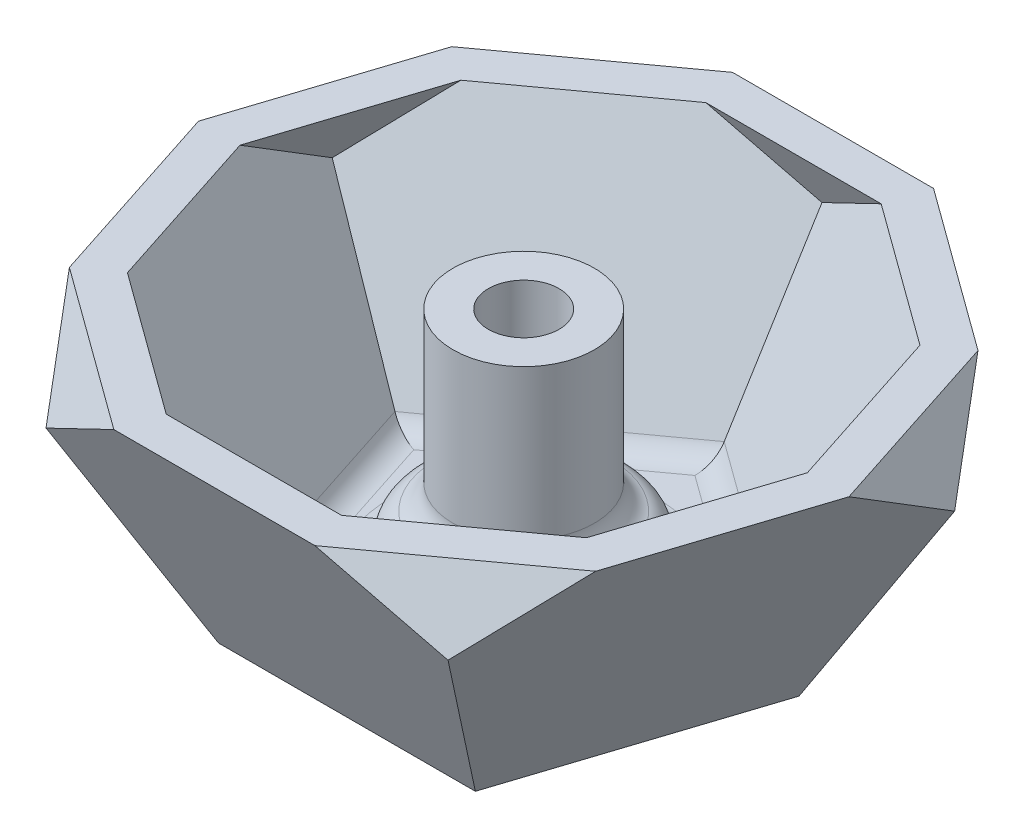
ISO-10303-21;
HEADER;
FILE_DESCRIPTION(('STEP AP214'),'2;1');
FILE_NAME('part.step','',(''),(''),'','','');
FILE_SCHEMA(('AUTOMOTIVE_DESIGN { 1 0 10303 214 1 1 1 1 }'));
ENDSEC;
DATA;
#1=APPLICATION_CONTEXT('core data for automotive mechanical design processes');
#2=APPLICATION_PROTOCOL_DEFINITION('international standard','automotive_design',2000,#1);
#3=PRODUCT_CONTEXT('',#1,'mechanical');
#4=PRODUCT('Part','Part','',(#3));
#5=PRODUCT_RELATED_PRODUCT_CATEGORY('part','',(#4));
#6=PRODUCT_DEFINITION_FORMATION('','',#4);
#7=PRODUCT_DEFINITION_CONTEXT('part definition',#1,'design');
#8=PRODUCT_DEFINITION('design','',#6,#7);
#9=PRODUCT_DEFINITION_SHAPE('','',#8);
#10=(LENGTH_UNIT() NAMED_UNIT(*) SI_UNIT(.MILLI.,.METRE.));
#11=(NAMED_UNIT(*) PLANE_ANGLE_UNIT() SI_UNIT($,.RADIAN.));
#12=(NAMED_UNIT(*) SI_UNIT($,.STERADIAN.) SOLID_ANGLE_UNIT());
#13=UNCERTAINTY_MEASURE_WITH_UNIT(LENGTH_MEASURE(1.E-05),#10,'distance_accuracy_value','');
#14=(GEOMETRIC_REPRESENTATION_CONTEXT(3) GLOBAL_UNCERTAINTY_ASSIGNED_CONTEXT((#13)) GLOBAL_UNIT_ASSIGNED_CONTEXT((#10,
#11,#12)) REPRESENTATION_CONTEXT('',''));
#15=CARTESIAN_POINT('',(0.,0.,0.));
#16=DIRECTION('',(0.,0.,1.));
#17=DIRECTION('',(1.,0.,0.));
#18=AXIS2_PLACEMENT_3D('',#15,#16,#17);
#19=CARTESIAN_POINT('',(0.,2.,0.));
#20=DIRECTION('',(0.,1.,0.));
#21=DIRECTION('',(0.,0.,1.));
#22=AXIS2_PLACEMENT_3D('',#19,#20,#21);
#23=PLANE('',#22);
#24=CARTESIAN_POINT('',(0.,2.,0.));
#25=DIRECTION('',(0.,1.,0.));
#26=DIRECTION('',(0.,0.,1.));
#27=AXIS2_PLACEMENT_3D('',#24,#25,#26);
#28=CIRCLE('',#27,7.5);
#29=CARTESIAN_POINT('',(0.,2.,7.5));
#30=VERTEX_POINT('',#29);
#31=EDGE_CURVE('E363',#30,#30,#28,.F.);
#32=ORIENTED_EDGE('',*,*,#31,.T.);
#33=EDGE_LOOP('',(#32));
#34=FACE_BOUND('',#33,.T.);
#35=DIRECTION('',(-0.309016994374946,0.,0.951056516295154));
#36=VECTOR('',#35,1.);
#37=CARTESIAN_POINT('',(9.42094211153315,2.,-3.63399866594965));
#38=LINE('',#37,#36);
#39=CARTESIAN_POINT('',(5.69382736211469,2.,7.83688103949869));
#40=VERTEX_POINT('',#39);
#41=CARTESIAN_POINT('',(9.21280619797569,2.,-2.99342219129891));
#42=VERTEX_POINT('',#41);
#43=EDGE_CURVE('E358',#40,#42,#38,.F.);
#44=ORIENTED_EDGE('',*,*,#43,.T.);
#45=DIRECTION('',(0.809016994374949,0.,0.587785252292472));
#46=VECTOR('',#45,1.);
#47=CARTESIAN_POINT('',(-0.544906895972963,2.,-10.0828157301274));
#48=LINE('',#47,#46);
#49=CARTESIAN_POINT('',(0.,2.,-9.68691769639961));
#50=VERTEX_POINT('',#49);
#51=EDGE_CURVE('E360',#42,#50,#48,.F.);
#52=ORIENTED_EDGE('',*,*,#51,.T.);
#53=DIRECTION('',(0.809016994374947,0.,-0.587785252292474));
#54=VECTOR('',#53,1.);
#55=CARTESIAN_POINT('',(-9.75771309394865,2.,-2.59752415757114));
#56=LINE('',#55,#54);
#57=CARTESIAN_POINT('',(-9.21280619797569,2.,-2.99342219129888));
#58=VERTEX_POINT('',#57);
#59=EDGE_CURVE('E352',#50,#58,#56,.F.);
#60=ORIENTED_EDGE('',*,*,#59,.T.);
#61=DIRECTION('',(-0.309016994374949,0.,-0.951056516295153));
#62=VECTOR('',#61,1.);
#63=CARTESIAN_POINT('',(-5.48569144855719,2.,8.47745751414945));
#64=LINE('',#63,#62);
#65=CARTESIAN_POINT('',(-5.69382736211466,2.,7.83688103949871));
#66=VERTEX_POINT('',#65);
#67=EDGE_CURVE('E354',#58,#66,#64,.F.);
#68=ORIENTED_EDGE('',*,*,#67,.T.);
#69=DIRECTION('',(-1.,0.,0.));
#70=VECTOR('',#69,1.);
#71=CARTESIAN_POINT('',(6.36736932694566,2.,7.83688103949869));
#72=LINE('',#71,#70);
#73=EDGE_CURVE('E356',#66,#40,#72,.F.);
#74=ORIENTED_EDGE('',*,*,#73,.T.);
#75=EDGE_LOOP('',(#44,#52,#60,#68,#74));
#76=FACE_BOUND('',#75,.T.);
#77=ADVANCED_FACE('F40',(#34,#76),#23,.T.);
#78=CARTESIAN_POINT('',(11.7557050458495,0.,-3.81966011250107));
#79=DIRECTION('',(0.525731112105726,-0.447213595545573,-0.723606797731528));
#80=DIRECTION('',(-0.809016994374948,0.,-0.587785252292472));
#81=AXIS2_PLACEMENT_3D('',#78,#79,#80);
#82=PLANE('',#81);
#83=DIRECTION('',(0.809016994374948,0.,0.587785252292472));
#84=VECTOR('',#83,1.);
#85=CARTESIAN_POINT('',(16.1640944386051,15.,-9.88728757108681));
#86=LINE('',#85,#84);
#87=CARTESIAN_POINT('',(14.8863891469741,15.,-10.8155948037142));
#88=VERTEX_POINT('',#87);
#89=CARTESIAN_POINT('',(5.68609468438653,15.,-17.5000000009563));
#90=VERTEX_POINT('',#89);
#91=EDGE_CURVE('E273',#88,#90,#86,.F.);
#92=ORIENTED_EDGE('',*,*,#91,.F.);
#93=DIRECTION('',(-0.500000000017621,0.52573111207063,-0.688190960259838));
#94=VECTOR('',#93,1.);
#95=CARTESIAN_POINT('',(20.4539709689218,9.1458980346127,-3.1524758432414));
#96=LINE('',#95,#94);
#97=CARTESIAN_POINT('',(18.4005889251751,11.3049516852663,-5.97871376407452));
#98=VERTEX_POINT('',#97);
#99=EDGE_CURVE('E315',#98,#88,#96,.T.);
#100=ORIENTED_EDGE('',*,*,#99,.F.);
#101=DIRECTION('',(-0.50000000004613,-0.850650808322063,0.162459848131442));
#102=VECTOR('',#101,1.);
#103=CARTESIAN_POINT('',(11.7557050458495,0.,-3.81966011250107));
#104=LINE('',#103,#102);
#105=CARTESIAN_POINT('',(11.7557050458495,0.,-3.81966011250107));
#106=VERTEX_POINT('',#105);
#107=EDGE_CURVE('E333',#98,#106,#104,.T.);
#108=ORIENTED_EDGE('',*,*,#107,.T.);
#109=DIRECTION('',(-0.809016994374948,0.,-0.587785252292472));
#110=VECTOR('',#109,1.);
#111=CARTESIAN_POINT('',(11.7557050458495,0.,-3.81966011250107));
#112=LINE('',#111,#110);
#113=CARTESIAN_POINT('',(0.,0.,-12.3606797749979));
#114=VERTEX_POINT('',#113);
#115=EDGE_CURVE('E318',#106,#114,#112,.T.);
#116=ORIENTED_EDGE('',*,*,#115,.T.);
#117=DIRECTION('',(0.,-0.850650808322063,0.525731112167637));
#118=VECTOR('',#117,1.);
#119=CARTESIAN_POINT('',(0.,0.,-12.3606797749979));
#120=LINE('',#119,#118);
#121=CARTESIAN_POINT('',(0.,11.3049516852663,-19.3475241585587));
#122=VERTEX_POINT('',#121);
#123=EDGE_CURVE('E334',#122,#114,#120,.T.);
#124=ORIENTED_EDGE('',*,*,#123,.F.);
#125=DIRECTION('',(-0.809016994403458,-0.52573111207063,-0.262865556068829));
#126=VECTOR('',#125,1.);
#127=CARTESIAN_POINT('',(6.18812322495092,15.3262379217593,-17.3368810400558));
#128=LINE('',#127,#126);
#129=EDGE_CURVE('E296',#90,#122,#128,.T.);
#130=ORIENTED_EDGE('',*,*,#129,.F.);
#131=EDGE_LOOP('',(#92,#100,#108,#116,#124,#130));
#132=FACE_BOUND('',#131,.T.);
#133=ADVANCED_FACE('F412',(#132),#82,.T.);
#134=CARTESIAN_POINT('',(0.,0.,-12.3606797749979));
#135=DIRECTION('',(-0.525731112105729,-0.447213595545573,-0.723606797731526));
#136=DIRECTION('',(-0.809016994374947,0.,0.587785252292474));
#137=AXIS2_PLACEMENT_3D('',#134,#135,#136);
#138=PLANE('',#137);
#139=DIRECTION('',(0.809016994374947,0.,-0.587785252292474));
#140=VECTOR('',#139,1.);
#141=CARTESIAN_POINT('',(-4.40838939275564,15.,-18.4283072335836));
#142=LINE('',#141,#140);
#143=CARTESIAN_POINT('',(-5.68609468438658,15.,-17.5000000009562));
#144=VERTEX_POINT('',#143);
#145=CARTESIAN_POINT('',(-14.8863891469741,15.,-10.8155948037141));
#146=VERTEX_POINT('',#145);
#147=EDGE_CURVE('E222',#144,#146,#142,.F.);
#148=ORIENTED_EDGE('',*,*,#147,.F.);
#149=DIRECTION('',(-0.809016994403457,0.52573111207063,0.262865556068831));
#150=VECTOR('',#149,1.);
#151=CARTESIAN_POINT('',(3.32244193867087,9.14589803461271,-20.4270509840231));
#152=LINE('',#151,#150);
#153=EDGE_CURVE('E293',#122,#144,#152,.T.);
#154=ORIENTED_EDGE('',*,*,#153,.F.);
#155=ORIENTED_EDGE('',*,*,#123,.T.);
#156=DIRECTION('',(-0.809016994374947,0.,0.587785252292474));
#157=VECTOR('',#156,1.);
#158=CARTESIAN_POINT('',(0.,0.,-12.3606797749979));
#159=LINE('',#158,#157);
#160=CARTESIAN_POINT('',(-11.7557050458495,0.,-3.81966011250103));
#161=VERTEX_POINT('',#160);
#162=EDGE_CURVE('E321',#114,#161,#159,.T.);
#163=ORIENTED_EDGE('',*,*,#162,.T.);
#164=DIRECTION('',(0.50000000004613,-0.850650808322063,0.162459848131441));
#165=VECTOR('',#164,1.);
#166=CARTESIAN_POINT('',(-11.7557050458495,0.,-3.81966011250103));
#167=LINE('',#166,#165);
#168=CARTESIAN_POINT('',(-18.4005889251751,11.3049516852663,-5.97871376407446));
#169=VERTEX_POINT('',#168);
#170=EDGE_CURVE('E337',#169,#161,#167,.T.);
#171=ORIENTED_EDGE('',*,*,#170,.F.);
#172=DIRECTION('',(-0.500000000017619,-0.52573111207063,0.688190960259839));
#173=VECTOR('',#172,1.);
#174=CARTESIAN_POINT('',(-14.5761184455828,15.3262379217593,-11.242645787561));
#175=LINE('',#174,#173);
#176=EDGE_CURVE('E301',#146,#169,#175,.T.);
#177=ORIENTED_EDGE('',*,*,#176,.F.);
#178=EDGE_LOOP('',(#148,#154,#155,#163,#171,#177));
#179=FACE_BOUND('',#178,.T.);
#180=ADVANCED_FACE('F418',(#179),#138,.T.);
#181=CARTESIAN_POINT('',(-11.7557050458495,0.,-3.81966011250103));
#182=DIRECTION('',(-0.850650808330348,-0.447213595545573,0.276393202242974));
#183=DIRECTION('',(0.46534112724147,-0.88513142261341,0.));
#184=AXIS2_PLACEMENT_3D('',#181,#182,#183);
#185=PLANE('',#184);
#186=DIRECTION('',(-0.309016994374949,0.,-0.951056516295153));
#187=VECTOR('',#186,1.);
#188=CARTESIAN_POINT('',(-18.8886289189726,15.,-1.50203265439342));
#189=LINE('',#188,#187);
#190=CARTESIAN_POINT('',(-18.4005889251751,15.,0.));
#191=VERTEX_POINT('',#190);
#192=CARTESIAN_POINT('',(-14.8863891469741,15.,10.8155948037142));
#193=VERTEX_POINT('',#192);
#194=EDGE_CURVE('E283',#191,#193,#189,.F.);
#195=ORIENTED_EDGE('',*,*,#194,.F.);
#196=DIRECTION('',(0.,0.52573111207063,0.850650808382017));
#197=VECTOR('',#196,1.);
#198=CARTESIAN_POINT('',(-18.4005889251751,9.14589803461271,-9.47213595481186));
#199=LINE('',#198,#197);
#200=EDGE_CURVE('E298',#169,#191,#199,.T.);
#201=ORIENTED_EDGE('',*,*,#200,.F.);
#202=ORIENTED_EDGE('',*,*,#170,.T.);
#203=DIRECTION('',(0.309016994374949,0.,0.951056516295153));
#204=VECTOR('',#203,1.);
#205=CARTESIAN_POINT('',(-11.7557050458495,0.,-3.81966011250103));
#206=LINE('',#205,#204);
#207=CARTESIAN_POINT('',(-7.26542528005359,0.,10.));
#208=VERTEX_POINT('',#207);
#209=EDGE_CURVE('E324',#161,#208,#206,.T.);
#210=ORIENTED_EDGE('',*,*,#209,.T.);
#211=DIRECTION('',(0.309016994403456,-0.850650808322063,-0.425325404215261));
#212=VECTOR('',#211,1.);
#213=CARTESIAN_POINT('',(-7.26542528005359,0.,10.));
#214=LINE('',#213,#212);
#215=CARTESIAN_POINT('',(-11.3721893687731,11.3049516852663,15.6524758433538));
#216=VERTEX_POINT('',#215);
#217=EDGE_CURVE('E341',#216,#208,#214,.T.);
#218=ORIENTED_EDGE('',*,*,#217,.F.);
#219=DIRECTION('',(0.500000000017621,-0.52573111207063,0.688190960259838));
#220=VECTOR('',#219,1.);
#221=CARTESIAN_POINT('',(-15.1966598483654,15.3262379217593,10.3885438198673));
#222=LINE('',#221,#220);
#223=EDGE_CURVE('E306',#193,#216,#222,.T.);
#224=ORIENTED_EDGE('',*,*,#223,.F.);
#225=EDGE_LOOP('',(#195,#201,#202,#210,#218,#224));
#226=FACE_BOUND('',#225,.T.);
#227=ADVANCED_FACE('F460',(#226),#185,.T.);
#228=CARTESIAN_POINT('',(-7.26542528005359,0.,10.));
#229=DIRECTION('',(0.,-0.447213595545573,0.894427190977108));
#230=DIRECTION('',(0.,-0.894427190977108,-0.447213595545573));
#231=AXIS2_PLACEMENT_3D('',#228,#229,#230);
#232=PLANE('',#231);
#233=DIRECTION('',(-1.,0.,0.));
#234=VECTOR('',#233,1.);
#235=CARTESIAN_POINT('',(-7.26542528005358,15.,17.5000000009563));
#236=LINE('',#235,#234);
#237=CARTESIAN_POINT('',(-5.68609468438655,15.,17.5000000009563));
#238=VERTEX_POINT('',#237);
#239=CARTESIAN_POINT('',(5.68609468438658,15.,17.5000000009562));
#240=VERTEX_POINT('',#239);
#241=EDGE_CURVE('E291',#238,#240,#236,.F.);
#242=ORIENTED_EDGE('',*,*,#241,.F.);
#243=DIRECTION('',(0.809016994403457,0.525731112070631,0.262865556068829));
#244=VECTOR('',#243,1.);
#245=CARTESIAN_POINT('',(-14.694631307444,9.14589803461271,14.5729490178894));
#246=LINE('',#245,#244);
#247=EDGE_CURVE('E303',#216,#238,#246,.T.);
#248=ORIENTED_EDGE('',*,*,#247,.F.);
#249=ORIENTED_EDGE('',*,*,#217,.T.);
#250=DIRECTION('',(1.,0.,0.));
#251=VECTOR('',#250,1.);
#252=CARTESIAN_POINT('',(-7.26542528005359,0.,10.));
#253=LINE('',#252,#251);
#254=CARTESIAN_POINT('',(7.26542528005363,0.,9.99999999999998));
#255=VERTEX_POINT('',#254);
#256=EDGE_CURVE('E327',#208,#255,#253,.T.);
#257=ORIENTED_EDGE('',*,*,#256,.T.);
#258=DIRECTION('',(-0.309016994403458,-0.850650808322063,-0.42532540421526));
#259=VECTOR('',#258,1.);
#260=CARTESIAN_POINT('',(7.26542528005363,0.,9.99999999999998));
#261=LINE('',#260,#259);
#262=CARTESIAN_POINT('',(11.3721893687732,11.3049516852663,15.6524758433538));
#263=VERTEX_POINT('',#262);
#264=EDGE_CURVE('E339',#263,#255,#261,.T.);
#265=ORIENTED_EDGE('',*,*,#264,.F.);
#266=DIRECTION('',(0.809016994403457,-0.52573111207063,-0.262865556068831));
#267=VECTOR('',#266,1.);
#268=CARTESIAN_POINT('',(5.1840661438222,15.3262379217593,17.6631189618567));
#269=LINE('',#268,#267);
#270=EDGE_CURVE('E311',#240,#263,#269,.T.);
#271=ORIENTED_EDGE('',*,*,#270,.F.);
#272=EDGE_LOOP('',(#242,#248,#249,#257,#265,#271));
#273=FACE_BOUND('',#272,.T.);
#274=ADVANCED_FACE('F456',(#273),#232,.T.);
#275=CARTESIAN_POINT('',(7.26542528005363,0.,9.99999999999998));
#276=DIRECTION('',(0.850650808330349,-0.447213595545573,0.276393202242972));
#277=DIRECTION('',(0.465341127241469,0.88513142261341,0.));
#278=AXIS2_PLACEMENT_3D('',#275,#276,#277);
#279=PLANE('',#278);
#280=DIRECTION('',(-0.309016994374946,0.,0.951056516295154));
#281=VECTOR('',#280,1.);
#282=CARTESIAN_POINT('',(14.3983491531767,15.,12.3176274581076));
#283=LINE('',#282,#281);
#284=CARTESIAN_POINT('',(14.8863891469741,15.,10.8155948037141));
#285=VERTEX_POINT('',#284);
#286=CARTESIAN_POINT('',(18.4005889251751,15.,0.));
#287=VERTEX_POINT('',#286);
#288=EDGE_CURVE('E281',#285,#287,#283,.F.);
#289=ORIENTED_EDGE('',*,*,#288,.F.);
#290=DIRECTION('',(0.500000000017619,0.52573111207063,-0.688190960259839));
#291=VECTOR('',#290,1.);
#292=CARTESIAN_POINT('',(9.31880732502645,9.14589803461271,18.4787137641869));
#293=LINE('',#292,#291);
#294=EDGE_CURVE('E308',#263,#285,#293,.T.);
#295=ORIENTED_EDGE('',*,*,#294,.F.);
#296=ORIENTED_EDGE('',*,*,#264,.T.);
#297=DIRECTION('',(0.309016994374946,0.,-0.951056516295154));
#298=VECTOR('',#297,1.);
#299=CARTESIAN_POINT('',(7.26542528005363,0.,9.99999999999998));
#300=LINE('',#299,#298);
#301=EDGE_CURVE('E330',#255,#106,#300,.T.);
#302=ORIENTED_EDGE('',*,*,#301,.T.);
#303=ORIENTED_EDGE('',*,*,#107,.F.);
#304=DIRECTION('',(0.,-0.52573111207063,-0.850650808382017));
#305=VECTOR('',#304,1.);
#306=CARTESIAN_POINT('',(18.4005889251751,15.3262379217593,0.527864045892893));
#307=LINE('',#306,#305);
#308=EDGE_CURVE('E313',#287,#98,#307,.T.);
#309=ORIENTED_EDGE('',*,*,#308,.F.);
#310=EDGE_LOOP('',(#289,#295,#296,#302,#303,#309));
#311=FACE_BOUND('',#310,.T.);
#312=ADVANCED_FACE('F434',(#311),#279,.T.);
#313=CARTESIAN_POINT('',(11.7557050458495,30.,3.81966011250104));
#314=DIRECTION('',(-0.850650808330348,-0.447213595545573,0.276393202242974));
#315=DIRECTION('',(0.46534112724147,-0.88513142261341,0.));
#316=AXIS2_PLACEMENT_3D('',#313,#314,#315);
#317=PLANE('',#316);
#318=ORIENTED_EDGE('',*,*,#99,.T.);
#319=DIRECTION('',(-0.309016994374948,0.,-0.951056516295153));
#320=VECTOR('',#319,1.);
#321=CARTESIAN_POINT('',(18.8886289189726,15.,1.50203265439343));
#322=LINE('',#321,#320);
#323=EDGE_CURVE('E278',#88,#287,#322,.F.);
#324=ORIENTED_EDGE('',*,*,#323,.T.);
#325=ORIENTED_EDGE('',*,*,#308,.T.);
#326=EDGE_LOOP('',(#318,#324,#325));
#327=FACE_BOUND('',#326,.T.);
#328=ADVANCED_FACE('F430',(#327),#317,.F.);
#329=CARTESIAN_POINT('',(0.,30.,12.3606797749979));
#330=DIRECTION('',(-0.525731112105728,-0.447213595545573,-0.723606797731526));
#331=DIRECTION('',(-0.809016994374947,0.,0.587785252292474));
#332=AXIS2_PLACEMENT_3D('',#329,#330,#331);
#333=PLANE('',#332);
#334=ORIENTED_EDGE('',*,*,#294,.T.);
#335=DIRECTION('',(0.809016994374947,0.,-0.587785252292474));
#336=VECTOR('',#335,1.);
#337=CARTESIAN_POINT('',(4.40838939275563,15.,18.4283072335836));
#338=LINE('',#337,#336);
#339=EDGE_CURVE('E288',#285,#240,#338,.F.);
#340=ORIENTED_EDGE('',*,*,#339,.T.);
#341=ORIENTED_EDGE('',*,*,#270,.T.);
#342=EDGE_LOOP('',(#334,#340,#341));
#343=FACE_BOUND('',#342,.T.);
#344=ADVANCED_FACE('F433',(#343),#333,.F.);
#345=CARTESIAN_POINT('',(-11.7557050458495,30.,3.81966011250106));
#346=DIRECTION('',(0.525731112105727,-0.447213595545573,-0.723606797731527));
#347=DIRECTION('',(-0.809016994374948,0.,-0.587785252292472));
#348=AXIS2_PLACEMENT_3D('',#345,#346,#347);
#349=PLANE('',#348);
#350=ORIENTED_EDGE('',*,*,#247,.T.);
#351=DIRECTION('',(0.809016994374948,0.,0.587785252292472));
#352=VECTOR('',#351,1.);
#353=CARTESIAN_POINT('',(-16.1640944386051,15.,9.88728757108679));
#354=LINE('',#353,#352);
#355=EDGE_CURVE('E285',#238,#193,#354,.F.);
#356=ORIENTED_EDGE('',*,*,#355,.T.);
#357=ORIENTED_EDGE('',*,*,#223,.T.);
#358=EDGE_LOOP('',(#350,#356,#357));
#359=FACE_BOUND('',#358,.T.);
#360=ADVANCED_FACE('F438',(#359),#349,.F.);
#361=CARTESIAN_POINT('',(-7.26542528005362,30.,-9.99999999999999));
#362=DIRECTION('',(0.850650808330349,-0.447213595545573,0.276393202242972));
#363=DIRECTION('',(0.465341127241469,0.88513142261341,0.));
#364=AXIS2_PLACEMENT_3D('',#361,#362,#363);
#365=PLANE('',#364);
#366=ORIENTED_EDGE('',*,*,#200,.T.);
#367=DIRECTION('',(-0.309016994374947,0.,0.951056516295154));
#368=VECTOR('',#367,1.);
#369=CARTESIAN_POINT('',(-14.3983491531767,15.,-12.3176274581076));
#370=LINE('',#369,#368);
#371=EDGE_CURVE('E275',#191,#146,#370,.F.);
#372=ORIENTED_EDGE('',*,*,#371,.T.);
#373=ORIENTED_EDGE('',*,*,#176,.T.);
#374=EDGE_LOOP('',(#366,#372,#373));
#375=FACE_BOUND('',#374,.T.);
#376=ADVANCED_FACE('F442',(#375),#365,.F.);
#377=CARTESIAN_POINT('',(7.26542528005359,30.,-10.));
#378=DIRECTION('',(0.,-0.447213595545573,0.894427190977108));
#379=DIRECTION('',(0.,-0.894427190977108,-0.447213595545574));
#380=AXIS2_PLACEMENT_3D('',#377,#378,#379);
#381=PLANE('',#380);
#382=ORIENTED_EDGE('',*,*,#153,.T.);
#383=DIRECTION('',(-1.,0.,0.));
#384=VECTOR('',#383,1.);
#385=CARTESIAN_POINT('',(7.26542528005359,15.,-17.5000000009563));
#386=LINE('',#385,#384);
#387=EDGE_CURVE('E336',#144,#90,#386,.F.);
#388=ORIENTED_EDGE('',*,*,#387,.T.);
#389=ORIENTED_EDGE('',*,*,#129,.T.);
#390=EDGE_LOOP('',(#382,#388,#389));
#391=FACE_BOUND('',#390,.T.);
#392=ADVANCED_FACE('F446',(#391),#381,.F.);
#393=CARTESIAN_POINT('',(0.,0.,0.));
#394=DIRECTION('',(0.,1.,0.));
#395=DIRECTION('',(0.,0.,1.));
#396=AXIS2_PLACEMENT_3D('',#393,#394,#395);
#397=PLANE('',#396);
#398=CARTESIAN_POINT('',(0.,0.,0.));
#399=DIRECTION('',(0.,1.,0.));
#400=DIRECTION('',(0.,0.,1.));
#401=AXIS2_PLACEMENT_3D('',#398,#399,#400);
#402=CIRCLE('',#401,4.5);
#403=CARTESIAN_POINT('',(0.,0.,4.5));
#404=VERTEX_POINT('',#403);
#405=EDGE_CURVE('E391',#404,#404,#402,.F.);
#406=ORIENTED_EDGE('',*,*,#405,.F.);
#407=EDGE_LOOP('',(#406));
#408=FACE_BOUND('',#407,.T.);
#409=ORIENTED_EDGE('',*,*,#115,.F.);
#410=ORIENTED_EDGE('',*,*,#301,.F.);
#411=ORIENTED_EDGE('',*,*,#256,.F.);
#412=ORIENTED_EDGE('',*,*,#209,.F.);
#413=ORIENTED_EDGE('',*,*,#162,.F.);
#414=EDGE_LOOP('',(#409,#410,#411,#412,#413));
#415=FACE_BOUND('',#414,.T.);
#416=ADVANCED_FACE('F428',(#408,#415),#397,.F.);
#417=CARTESIAN_POINT('',(0.,15.,0.));
#418=DIRECTION('',(0.,1.,0.));
#419=DIRECTION('',(0.,0.,1.));
#420=AXIS2_PLACEMENT_3D('',#417,#418,#419);
#421=PLANE('',#420);
#422=DIRECTION('',(-1.,0.,0.));
#423=VECTOR('',#422,1.);
#424=CARTESIAN_POINT('',(-7.26542528005358,15.,15.2639320233994));
#425=LINE('',#424,#423);
#426=CARTESIAN_POINT('',(-4.95955215636267,15.,15.2639320233994));
#427=VERTEX_POINT('',#426);
#428=CARTESIAN_POINT('',(4.9595521563627,15.,15.2639320233994));
#429=VERTEX_POINT('',#428);
#430=EDGE_CURVE('E215',#427,#429,#425,.F.);
#431=ORIENTED_EDGE('',*,*,#430,.F.);
#432=DIRECTION('',(0.809016994374948,0.,0.587785252292472));
#433=VECTOR('',#432,1.);
#434=CARTESIAN_POINT('',(-14.8497666582737,15.,8.07827057666571));
#435=LINE('',#434,#433);
#436=CARTESIAN_POINT('',(-12.9842761143353,15.,9.43362879242883));
#437=VERTEX_POINT('',#436);
#438=EDGE_CURVE('E261',#427,#437,#435,.F.);
#439=ORIENTED_EDGE('',*,*,#438,.T.);
#440=DIRECTION('',(-0.309016994374949,0.,-0.951056516295153));
#441=VECTOR('',#440,1.);
#442=CARTESIAN_POINT('',(-16.7620018980382,15.,-2.1930156600361));
#443=LINE('',#442,#441);
#444=CARTESIAN_POINT('',(-16.0494479159453,15.,0.));
#445=VERTEX_POINT('',#444);
#446=EDGE_CURVE('E258',#445,#437,#443,.F.);
#447=ORIENTED_EDGE('',*,*,#446,.F.);
#448=DIRECTION('',(-0.309016994374947,0.,0.951056516295154));
#449=VECTOR('',#448,1.);
#450=CARTESIAN_POINT('',(-12.2717221322424,15.,-11.6266444524649));
#451=LINE('',#450,#449);
#452=CARTESIAN_POINT('',(-12.9842761143353,15.,-9.43362879242878));
#453=VERTEX_POINT('',#452);
#454=EDGE_CURVE('E250',#445,#453,#451,.F.);
#455=ORIENTED_EDGE('',*,*,#454,.T.);
#456=DIRECTION('',(0.809016994374947,0.,-0.587785252292474));
#457=VECTOR('',#456,1.);
#458=CARTESIAN_POINT('',(-3.09406161242429,15.,-16.6192902391625));
#459=LINE('',#458,#457);
#460=CARTESIAN_POINT('',(-4.95955215636269,15.,-15.2639320233994));
#461=VERTEX_POINT('',#460);
#462=EDGE_CURVE('E251',#461,#453,#459,.F.);
#463=ORIENTED_EDGE('',*,*,#462,.F.);
#464=DIRECTION('',(-1.,0.,0.));
#465=VECTOR('',#464,1.);
#466=CARTESIAN_POINT('',(7.26542528005359,15.,-15.2639320233994));
#467=LINE('',#466,#465);
#468=CARTESIAN_POINT('',(4.95955215636265,15.,-15.2639320233994));
#469=VERTEX_POINT('',#468);
#470=EDGE_CURVE('E212',#461,#469,#467,.F.);
#471=ORIENTED_EDGE('',*,*,#470,.T.);
#472=DIRECTION('',(0.809016994374948,0.,0.587785252292472));
#473=VECTOR('',#472,1.);
#474=CARTESIAN_POINT('',(14.8497666582737,15.,-8.07827057666573));
#475=LINE('',#474,#473);
#476=CARTESIAN_POINT('',(12.9842761143353,15.,-9.43362879242883));
#477=VERTEX_POINT('',#476);
#478=EDGE_CURVE('E204',#477,#469,#475,.F.);
#479=ORIENTED_EDGE('',*,*,#478,.F.);
#480=DIRECTION('',(-0.309016994374948,0.,-0.951056516295153));
#481=VECTOR('',#480,1.);
#482=CARTESIAN_POINT('',(16.7620018980382,15.,2.1930156600361));
#483=LINE('',#482,#481);
#484=CARTESIAN_POINT('',(16.0494479159453,15.,0.));
#485=VERTEX_POINT('',#484);
#486=EDGE_CURVE('E257',#477,#485,#483,.F.);
#487=ORIENTED_EDGE('',*,*,#486,.T.);
#488=DIRECTION('',(-0.309016994374946,0.,0.951056516295154));
#489=VECTOR('',#488,1.);
#490=CARTESIAN_POINT('',(12.2717221322424,15.,11.6266444524649));
#491=LINE('',#490,#489);
#492=CARTESIAN_POINT('',(12.9842761143353,15.,9.43362879242878));
#493=VERTEX_POINT('',#492);
#494=EDGE_CURVE('E262',#493,#485,#491,.F.);
#495=ORIENTED_EDGE('',*,*,#494,.F.);
#496=DIRECTION('',(0.809016994374947,0.,-0.587785252292474));
#497=VECTOR('',#496,1.);
#498=CARTESIAN_POINT('',(3.09406161242428,15.,16.6192902391625));
#499=LINE('',#498,#497);
#500=EDGE_CURVE('E265',#493,#429,#499,.F.);
#501=ORIENTED_EDGE('',*,*,#500,.T.);
#502=EDGE_LOOP('',(#431,#439,#447,#455,#463,#471,#479,#487,#495,#501));
#503=FACE_BOUND('',#502,.T.);
#504=ORIENTED_EDGE('',*,*,#241,.T.);
#505=ORIENTED_EDGE('',*,*,#339,.F.);
#506=ORIENTED_EDGE('',*,*,#288,.T.);
#507=ORIENTED_EDGE('',*,*,#323,.F.);
#508=ORIENTED_EDGE('',*,*,#91,.T.);
#509=ORIENTED_EDGE('',*,*,#387,.F.);
#510=ORIENTED_EDGE('',*,*,#147,.T.);
#511=ORIENTED_EDGE('',*,*,#371,.F.);
#512=ORIENTED_EDGE('',*,*,#194,.T.);
#513=ORIENTED_EDGE('',*,*,#355,.F.);
#514=EDGE_LOOP('',(#504,#505,#506,#507,#508,#509,#510,#511,#512,#513));
#515=FACE_BOUND('',#514,.T.);
#516=ADVANCED_FACE('F425',(#503,#515),#421,.T.);
#517=CARTESIAN_POINT('',(10.704242821638,0.894427191091147,-2.37244651703802));
#518=DIRECTION('',(0.525731112105726,-0.447213595545573,-0.723606797731528));
#519=DIRECTION('',(-0.809016994374948,0.,-0.587785252292472));
#520=AXIS2_PLACEMENT_3D('',#517,#518,#519);
#521=PLANE('',#520);
#522=DIRECTION('',(0.,-0.850650808322063,0.525731112167637));
#523=VECTOR('',#522,1.);
#524=CARTESIAN_POINT('',(0.,1.23606797760179,-10.3606797750879));
#525=LINE('',#524,#523);
#526=CARTESIAN_POINT('',(0.,11.7770876402177,-16.8753882034961));
#527=VERTEX_POINT('',#526);
#528=CARTESIAN_POINT('',(0.,2.82917960668164,-11.3452769098575));
#529=VERTEX_POINT('',#528);
#530=EDGE_CURVE('E200',#527,#529,#525,.T.);
#531=ORIENTED_EDGE('',*,*,#530,.T.);
#532=DIRECTION('',(-0.809016994374948,0.,-0.587785252292472));
#533=VECTOR('',#532,1.);
#534=CARTESIAN_POINT('',(10.5463097621072,2.82917960668164,-3.68293435416847));
#535=LINE('',#534,#533);
#536=CARTESIAN_POINT('',(10.7899995342929,2.82917960668164,-3.50588337103566));
#537=VERTEX_POINT('',#536);
#538=EDGE_CURVE('E366',#529,#537,#535,.F.);
#539=ORIENTED_EDGE('',*,*,#538,.T.);
#540=DIRECTION('',(-0.50000000004613,-0.850650808322063,0.162459848131442));
#541=VECTOR('',#540,1.);
#542=CARTESIAN_POINT('',(9.85359201334471,1.23606797760179,-3.20162612377897));
#543=LINE('',#542,#541);
#544=CARTESIAN_POINT('',(16.0494479159453,11.7770876402177,-5.21478174155482));
#545=VERTEX_POINT('',#544);
#546=EDGE_CURVE('E227',#545,#537,#543,.T.);
#547=ORIENTED_EDGE('',*,*,#546,.F.);
#548=DIRECTION('',(-0.500000000017621,0.52573111207063,-0.688190960259838));
#549=VECTOR('',#548,1.);
#550=CARTESIAN_POINT('',(18.551857936283,9.1458980346127,-1.77050983195605));
#551=LINE('',#550,#549);
#552=EDGE_CURVE('E249',#545,#477,#551,.T.);
#553=ORIENTED_EDGE('',*,*,#552,.T.);
#554=ORIENTED_EDGE('',*,*,#478,.T.);
#555=DIRECTION('',(-0.809016994403458,-0.52573111207063,-0.262865556068829));
#556=VECTOR('',#555,1.);
#557=CARTESIAN_POINT('',(5.46158069692704,15.3262379217593,-15.100813062499));
#558=LINE('',#557,#556);
#559=EDGE_CURVE('E195',#469,#527,#558,.T.);
#560=ORIENTED_EDGE('',*,*,#559,.T.);
#561=EDGE_LOOP('',(#531,#539,#547,#553,#554,#560));
#562=FACE_BOUND('',#561,.T.);
#563=ADVANCED_FACE('F197',(#562),#521,.F.);
#564=CARTESIAN_POINT('',(1.05146222421144,0.894427191091147,-10.9134661795348));
#565=DIRECTION('',(-0.525731112105729,-0.447213595545573,-0.723606797731526));
#566=DIRECTION('',(-0.809016994374947,0.,0.587785252292474));
#567=AXIS2_PLACEMENT_3D('',#564,#565,#566);
#568=PLANE('',#567);
#569=DIRECTION('',(0.50000000004613,-0.850650808322063,0.162459848131441));
#570=VECTOR('',#569,1.);
#571=CARTESIAN_POINT('',(-9.85359201334471,1.23606797760179,-3.20162612377894));
#572=LINE('',#571,#570);
#573=CARTESIAN_POINT('',(-16.0494479159453,11.7770876402177,-5.21478174155477));
#574=VERTEX_POINT('',#573);
#575=CARTESIAN_POINT('',(-10.7899995342929,2.82917960668164,-3.50588337103562));
#576=VERTEX_POINT('',#575);
#577=EDGE_CURVE('E220',#574,#576,#572,.T.);
#578=ORIENTED_EDGE('',*,*,#577,.T.);
#579=DIRECTION('',(-0.809016994374947,0.,0.587785252292474));
#580=VECTOR('',#579,1.);
#581=CARTESIAN_POINT('',(-0.243689772185654,2.82917960668164,-11.1682259267246));
#582=LINE('',#581,#580);
#583=EDGE_CURVE('E219',#576,#529,#582,.F.);
#584=ORIENTED_EDGE('',*,*,#583,.T.);
#585=ORIENTED_EDGE('',*,*,#530,.F.);
#586=DIRECTION('',(-0.809016994403457,0.52573111207063,0.262865556068831));
#587=VECTOR('',#586,1.);
#588=CARTESIAN_POINT('',(4.04898446669476,9.14589803461272,-18.1909830064663));
#589=LINE('',#588,#587);
#590=EDGE_CURVE('E208',#527,#461,#589,.T.);
#591=ORIENTED_EDGE('',*,*,#590,.T.);
#592=ORIENTED_EDGE('',*,*,#462,.T.);
#593=DIRECTION('',(-0.500000000017619,-0.52573111207063,0.688190960259839));
#594=VECTOR('',#593,1.);
#595=CARTESIAN_POINT('',(-12.674005412944,15.3262379217593,-9.86067977627567));
#596=LINE('',#595,#594);
#597=EDGE_CURVE('E230',#453,#574,#596,.T.);
#598=ORIENTED_EDGE('',*,*,#597,.T.);
#599=EDGE_LOOP('',(#578,#584,#585,#591,#592,#598));
#600=FACE_BOUND('',#599,.T.);
#601=ADVANCED_FACE('F217',(#600),#568,.F.);
#602=CARTESIAN_POINT('',(-10.0544034291888,0.894427191091147,-4.37244651698698));
#603=DIRECTION('',(-0.850650808330348,-0.447213595545573,0.276393202242974));
#604=DIRECTION('',(0.46534112724147,-0.88513142261341,0.));
#605=AXIS2_PLACEMENT_3D('',#602,#603,#604);
#606=PLANE('',#605);
#607=DIRECTION('',(0.309016994403456,-0.850650808322063,-0.425325404215261));
#608=VECTOR('',#607,1.);
#609=CARTESIAN_POINT('',(-6.08985477552152,1.23606797760179,8.38196601132289));
#610=LINE('',#609,#608);
#611=CARTESIAN_POINT('',(-9.91910431272533,11.7770876402177,13.6524758433028));
#612=VERTEX_POINT('',#611);
#613=CARTESIAN_POINT('',(-6.66858645078852,2.82917960668164,9.17852182596438));
#614=VERTEX_POINT('',#613);
#615=EDGE_CURVE('E224',#612,#614,#610,.T.);
#616=ORIENTED_EDGE('',*,*,#615,.T.);
#617=DIRECTION('',(0.309016994374949,0.,0.951056516295153));
#618=VECTOR('',#617,1.);
#619=CARTESIAN_POINT('',(-10.6969183240287,2.82917960668164,-3.21940886258516));
#620=LINE('',#619,#618);
#621=EDGE_CURVE('E55',#614,#576,#620,.F.);
#622=ORIENTED_EDGE('',*,*,#621,.T.);
#623=ORIENTED_EDGE('',*,*,#577,.F.);
#624=DIRECTION('',(0.,0.52573111207063,0.850650808382017));
#625=VECTOR('',#624,1.);
#626=CARTESIAN_POINT('',(-16.0494479159453,9.14589803461272,-9.47213595481187));
#627=LINE('',#626,#625);
#628=EDGE_CURVE('E207',#574,#445,#627,.T.);
#629=ORIENTED_EDGE('',*,*,#628,.T.);
#630=ORIENTED_EDGE('',*,*,#446,.T.);
#631=DIRECTION('',(0.500000000017621,-0.52573111207063,0.688190960259838));
#632=VECTOR('',#631,1.);
#633=CARTESIAN_POINT('',(-13.2945468157266,15.3262379217593,9.00657780858193));
#634=LINE('',#633,#632);
#635=EDGE_CURVE('E237',#437,#612,#634,.T.);
#636=ORIENTED_EDGE('',*,*,#635,.T.);
#637=EDGE_LOOP('',(#616,#622,#623,#629,#630,#636));
#638=FACE_BOUND('',#637,.T.);
#639=ADVANCED_FACE('F577',(#638),#606,.F.);
#640=CARTESIAN_POINT('',(-7.26542528005359,0.894427191091147,8.21114561804579));
#641=DIRECTION('',(0.,-0.447213595545573,0.894427190977108));
#642=DIRECTION('',(0.,-0.894427190977108,-0.447213595545573));
#643=AXIS2_PLACEMENT_3D('',#640,#641,#642);
#644=PLANE('',#643);
#645=DIRECTION('',(-0.309016994403458,-0.850650808322063,-0.42532540421526));
#646=VECTOR('',#645,1.);
#647=CARTESIAN_POINT('',(6.08985477552155,1.23606797760179,8.38196601132287));
#648=LINE('',#647,#646);
#649=CARTESIAN_POINT('',(9.91910431272538,11.7770876402177,13.6524758433028));
#650=VERTEX_POINT('',#649);
#651=CARTESIAN_POINT('',(6.66858645078855,2.82917960668164,9.17852182596436));
#652=VERTEX_POINT('',#651);
#653=EDGE_CURVE('E236',#650,#652,#648,.T.);
#654=ORIENTED_EDGE('',*,*,#653,.T.);
#655=DIRECTION('',(1.,0.,0.));
#656=VECTOR('',#655,1.);
#657=CARTESIAN_POINT('',(-6.36736932694563,2.82917960668164,9.17852182596438));
#658=LINE('',#657,#656);
#659=EDGE_CURVE('E63',#652,#614,#658,.F.);
#660=ORIENTED_EDGE('',*,*,#659,.T.);
#661=ORIENTED_EDGE('',*,*,#615,.F.);
#662=DIRECTION('',(0.809016994403457,0.525731112070631,0.262865556068829));
#663=VECTOR('',#662,1.);
#664=CARTESIAN_POINT('',(-13.9680887794201,9.14589803461271,12.3368810403326));
#665=LINE('',#664,#663);
#666=EDGE_CURVE('E232',#612,#427,#665,.T.);
#667=ORIENTED_EDGE('',*,*,#666,.T.);
#668=ORIENTED_EDGE('',*,*,#430,.T.);
#669=DIRECTION('',(0.809016994403457,-0.52573111207063,-0.262865556068831));
#670=VECTOR('',#669,1.);
#671=CARTESIAN_POINT('',(4.45752361579831,15.3262379217593,15.4270509842999));
#672=LINE('',#671,#670);
#673=EDGE_CURVE('E243',#429,#650,#672,.T.);
#674=ORIENTED_EDGE('',*,*,#673,.T.);
#675=EDGE_LOOP('',(#654,#660,#661,#667,#668,#674));
#676=FACE_BOUND('',#675,.T.);
#677=ADVANCED_FACE('F580',(#676),#644,.F.);
#678=CARTESIAN_POINT('',(5.56412366339293,0.894427191091147,9.44721359551404));
#679=DIRECTION('',(0.850650808330349,-0.447213595545573,0.276393202242972));
#680=DIRECTION('',(0.465341127241469,0.88513142261341,0.));
#681=AXIS2_PLACEMENT_3D('',#678,#679,#680);
#682=PLANE('',#681);
#683=ORIENTED_EDGE('',*,*,#546,.T.);
#684=DIRECTION('',(0.309016994374946,0.,-0.951056516295154));
#685=VECTOR('',#684,1.);
#686=CARTESIAN_POINT('',(6.76166766105275,2.82917960668164,8.89204731751389));
#687=LINE('',#686,#685);
#688=EDGE_CURVE('E368',#537,#652,#687,.F.);
#689=ORIENTED_EDGE('',*,*,#688,.T.);
#690=ORIENTED_EDGE('',*,*,#653,.F.);
#691=DIRECTION('',(0.500000000017619,0.52573111207063,-0.688190960259839));
#692=VECTOR('',#691,1.);
#693=CARTESIAN_POINT('',(7.41669429238764,9.14589803461271,17.0967477529016));
#694=LINE('',#693,#692);
#695=EDGE_CURVE('E239',#650,#493,#694,.T.);
#696=ORIENTED_EDGE('',*,*,#695,.T.);
#697=ORIENTED_EDGE('',*,*,#494,.T.);
#698=DIRECTION('',(0.,-0.52573111207063,-0.850650808382017));
#699=VECTOR('',#698,1.);
#700=CARTESIAN_POINT('',(16.0494479159453,15.3262379217593,0.527864045892898));
#701=LINE('',#700,#699);
#702=EDGE_CURVE('E245',#485,#545,#701,.T.);
#703=ORIENTED_EDGE('',*,*,#702,.T.);
#704=EDGE_LOOP('',(#683,#689,#690,#696,#697,#703));
#705=FACE_BOUND('',#704,.T.);
#706=ADVANCED_FACE('F512',(#705),#682,.F.);
#707=CARTESIAN_POINT('',(10.0544034291888,29.1055728089089,4.37244651698698));
#708=DIRECTION('',(-0.850650808330348,-0.447213595545573,0.276393202242974));
#709=DIRECTION('',(0.46534112724147,-0.88513142261341,0.));
#710=AXIS2_PLACEMENT_3D('',#707,#708,#709);
#711=PLANE('',#710);
#712=ORIENTED_EDGE('',*,*,#552,.F.);
#713=ORIENTED_EDGE('',*,*,#702,.F.);
#714=ORIENTED_EDGE('',*,*,#486,.F.);
#715=EDGE_LOOP('',(#712,#713,#714));
#716=FACE_BOUND('',#715,.T.);
#717=ADVANCED_FACE('F585',(#716),#711,.T.);
#718=CARTESIAN_POINT('',(-1.05146222421145,29.1055728089089,10.9134661795348));
#719=DIRECTION('',(-0.525731112105728,-0.447213595545573,-0.723606797731526));
#720=DIRECTION('',(-0.809016994374947,0.,0.587785252292474));
#721=AXIS2_PLACEMENT_3D('',#718,#719,#720);
#722=PLANE('',#721);
#723=ORIENTED_EDGE('',*,*,#695,.F.);
#724=ORIENTED_EDGE('',*,*,#673,.F.);
#725=ORIENTED_EDGE('',*,*,#500,.F.);
#726=EDGE_LOOP('',(#723,#724,#725));
#727=FACE_BOUND('',#726,.T.);
#728=ADVANCED_FACE('F588',(#727),#722,.T.);
#729=CARTESIAN_POINT('',(-10.704242821638,29.1055728089089,2.37244651703801));
#730=DIRECTION('',(0.525731112105727,-0.447213595545573,-0.723606797731527));
#731=DIRECTION('',(-0.809016994374948,0.,-0.587785252292472));
#732=AXIS2_PLACEMENT_3D('',#729,#730,#731);
#733=PLANE('',#732);
#734=ORIENTED_EDGE('',*,*,#666,.F.);
#735=ORIENTED_EDGE('',*,*,#635,.F.);
#736=ORIENTED_EDGE('',*,*,#438,.F.);
#737=EDGE_LOOP('',(#734,#735,#736));
#738=FACE_BOUND('',#737,.T.);
#739=ADVANCED_FACE('F592',(#738),#733,.T.);
#740=CARTESIAN_POINT('',(-5.56412366339292,29.1055728089089,-9.44721359551405));
#741=DIRECTION('',(0.850650808330349,-0.447213595545573,0.276393202242972));
#742=DIRECTION('',(0.465341127241469,0.88513142261341,0.));
#743=AXIS2_PLACEMENT_3D('',#740,#741,#742);
#744=PLANE('',#743);
#745=ORIENTED_EDGE('',*,*,#628,.F.);
#746=ORIENTED_EDGE('',*,*,#597,.F.);
#747=ORIENTED_EDGE('',*,*,#454,.F.);
#748=EDGE_LOOP('',(#745,#746,#747));
#749=FACE_BOUND('',#748,.T.);
#750=ADVANCED_FACE('F595',(#749),#744,.T.);
#751=CARTESIAN_POINT('',(7.2654252800536,29.1055728089089,-8.21114561804579));
#752=DIRECTION('',(0.,-0.447213595545573,0.894427190977108));
#753=DIRECTION('',(0.,-0.894427190977108,-0.447213595545574));
#754=AXIS2_PLACEMENT_3D('',#751,#752,#753);
#755=PLANE('',#754);
#756=ORIENTED_EDGE('',*,*,#590,.F.);
#757=ORIENTED_EDGE('',*,*,#559,.F.);
#758=ORIENTED_EDGE('',*,*,#470,.F.);
#759=EDGE_LOOP('',(#756,#757,#758));
#760=FACE_BOUND('',#759,.T.);
#761=ADVANCED_FACE('F211',(#760),#755,.T.);
#762=CARTESIAN_POINT('',(0.,5.,0.));
#763=DIRECTION('',(0.,-1.,0.));
#764=DIRECTION('',(0.,0.,-1.));
#765=AXIS2_PLACEMENT_3D('',#762,#763,#764);
#766=CYLINDRICAL_SURFACE('',#765,6.);
#767=CARTESIAN_POINT('',(0.,3.67157287525381,0.));
#768=DIRECTION('',(0.,-1.,0.));
#769=DIRECTION('',(0.,0.,-1.));
#770=AXIS2_PLACEMENT_3D('',#767,#768,#769);
#771=CIRCLE('',#770,6.);
#772=CARTESIAN_POINT('',(0.,3.67157287525381,-6.));
#773=VERTEX_POINT('',#772);
#774=EDGE_CURVE('E394',#773,#773,#771,.T.);
#775=ORIENTED_EDGE('',*,*,#774,.T.);
#776=EDGE_LOOP('',(#775));
#777=FACE_BOUND('',#776,.T.);
#778=CARTESIAN_POINT('',(0.,3.5,0.));
#779=DIRECTION('',(0.,1.,0.));
#780=DIRECTION('',(0.,0.,1.));
#781=AXIS2_PLACEMENT_3D('',#778,#779,#780);
#782=CIRCLE('',#781,6.);
#783=CARTESIAN_POINT('',(0.,3.5,6.));
#784=VERTEX_POINT('',#783);
#785=EDGE_CURVE('E349',#784,#784,#782,.T.);
#786=ORIENTED_EDGE('',*,*,#785,.T.);
#787=EDGE_LOOP('',(#786));
#788=FACE_BOUND('',#787,.T.);
#789=ADVANCED_FACE('F558',(#777,#788),#766,.T.);
#790=CARTESIAN_POINT('',(0.,26.3137084989848,0.));
#791=DIRECTION('',(0.,-1.,0.));
#792=DIRECTION('',(0.,0.,-1.));
#793=AXIS2_PLACEMENT_3D('',#790,#791,#792);
#794=CYLINDRICAL_SURFACE('',#793,2.);
#795=CARTESIAN_POINT('',(0.,4.,0.));
#796=DIRECTION('',(0.,1.,0.));
#797=DIRECTION('',(0.,0.,1.));
#798=AXIS2_PLACEMENT_3D('',#795,#796,#797);
#799=CIRCLE('',#798,2.);
#800=CARTESIAN_POINT('',(0.,4.,2.));
#801=VERTEX_POINT('',#800);
#802=EDGE_CURVE('E377',#801,#801,#799,.T.);
#803=ORIENTED_EDGE('',*,*,#802,.F.);
#804=EDGE_LOOP('',(#803));
#805=FACE_BOUND('',#804,.T.);
#806=CARTESIAN_POINT('',(0.,15.,0.));
#807=DIRECTION('',(0.,1.,0.));
#808=DIRECTION('',(0.,0.,1.));
#809=AXIS2_PLACEMENT_3D('',#806,#807,#808);
#810=CIRCLE('',#809,2.);
#811=CARTESIAN_POINT('',(0.,15.,2.));
#812=VERTEX_POINT('',#811);
#813=EDGE_CURVE('E388',#812,#812,#810,.T.);
#814=ORIENTED_EDGE('',*,*,#813,.T.);
#815=EDGE_LOOP('',(#814));
#816=FACE_BOUND('',#815,.T.);
#817=ADVANCED_FACE('F561',(#805,#816),#794,.F.);
#818=CARTESIAN_POINT('',(0.,15.,0.));
#819=DIRECTION('',(0.,1.,0.));
#820=DIRECTION('',(0.,0.,1.));
#821=AXIS2_PLACEMENT_3D('',#818,#819,#820);
#822=PLANE('',#821);
#823=ORIENTED_EDGE('',*,*,#813,.F.);
#824=EDGE_LOOP('',(#823));
#825=FACE_BOUND('',#824,.T.);
#826=CARTESIAN_POINT('',(0.,15.,0.));
#827=DIRECTION('',(0.,1.,0.));
#828=DIRECTION('',(0.,0.,1.));
#829=AXIS2_PLACEMENT_3D('',#826,#827,#828);
#830=CIRCLE('',#829,4.);
#831=CARTESIAN_POINT('',(0.,15.,4.));
#832=VERTEX_POINT('',#831);
#833=EDGE_CURVE('E254',#832,#832,#830,.T.);
#834=ORIENTED_EDGE('',*,*,#833,.T.);
#835=EDGE_LOOP('',(#834));
#836=FACE_BOUND('',#835,.T.);
#837=ADVANCED_FACE('F563',(#825,#836),#822,.T.);
#838=CARTESIAN_POINT('',(0.,26.3137084989848,0.));
#839=DIRECTION('',(0.,-1.,0.));
#840=DIRECTION('',(0.,0.,-1.));
#841=AXIS2_PLACEMENT_3D('',#838,#839,#840);
#842=CYLINDRICAL_SURFACE('',#841,4.);
#843=CARTESIAN_POINT('',(0.,6.5,0.));
#844=DIRECTION('',(0.,1.,0.));
#845=DIRECTION('',(0.,0.,1.));
#846=AXIS2_PLACEMENT_3D('',#843,#844,#845);
#847=CIRCLE('',#846,4.);
#848=CARTESIAN_POINT('',(0.,6.5,4.));
#849=VERTEX_POINT('',#848);
#850=EDGE_CURVE('E346',#849,#849,#847,.T.);
#851=ORIENTED_EDGE('',*,*,#850,.T.);
#852=EDGE_LOOP('',(#851));
#853=FACE_BOUND('',#852,.T.);
#854=ORIENTED_EDGE('',*,*,#833,.F.);
#855=EDGE_LOOP('',(#854));
#856=FACE_BOUND('',#855,.T.);
#857=ADVANCED_FACE('F472',(#853,#856),#842,.T.);
#858=CARTESIAN_POINT('',(0.,6.5,0.));
#859=DIRECTION('',(0.,1.,0.));
#860=DIRECTION('',(0.,0.,1.));
#861=AXIS2_PLACEMENT_3D('',#858,#859,#860);
#862=TOROIDAL_SURFACE('',#861,5.5,1.5);
#863=CARTESIAN_POINT('',(0.,5.08578643762695,0.));
#864=DIRECTION('',(0.,1.,0.));
#865=DIRECTION('',(0.,0.,1.));
#866=AXIS2_PLACEMENT_3D('',#863,#864,#865);
#867=CIRCLE('',#866,5.00000000000002);
#868=CARTESIAN_POINT('',(0.,5.08578643762695,5.00000000000002));
#869=VERTEX_POINT('',#868);
#870=EDGE_CURVE('E373',#869,#869,#867,.T.);
#871=ORIENTED_EDGE('',*,*,#870,.T.);
#872=EDGE_LOOP('',(#871));
#873=FACE_BOUND('',#872,.T.);
#874=ORIENTED_EDGE('',*,*,#850,.F.);
#875=EDGE_LOOP('',(#874));
#876=FACE_BOUND('',#875,.T.);
#877=ADVANCED_FACE('F468',(#873,#876),#862,.F.);
#878=CARTESIAN_POINT('',(0.,3.5,0.));
#879=DIRECTION('',(0.,1.,0.));
#880=DIRECTION('',(0.,0.,1.));
#881=AXIS2_PLACEMENT_3D('',#878,#879,#880);
#882=TOROIDAL_SURFACE('',#881,7.5,1.5);
#883=ORIENTED_EDGE('',*,*,#31,.F.);
#884=EDGE_LOOP('',(#883));
#885=FACE_BOUND('',#884,.T.);
#886=ORIENTED_EDGE('',*,*,#785,.F.);
#887=EDGE_LOOP('',(#886));
#888=FACE_BOUND('',#887,.T.);
#889=ADVANCED_FACE('F471',(#885,#888),#882,.F.);
#890=CARTESIAN_POINT('',(0.,3.5,7.8368810394987));
#891=DIRECTION('',(1.,0.,0.));
#892=DIRECTION('',(0.,0.,-1.));
#893=AXIS2_PLACEMENT_3D('',#890,#891,#892);
#894=CYLINDRICAL_SURFACE('',#893,1.5);
#895=CARTESIAN_POINT('',(5.69382736211468,3.5,7.83688103949869));
#896=DIRECTION('',(0.809016994374946,0.,-0.587785252292475));
#897=DIRECTION('',(-0.587785252292475,0.,-0.809016994374946));
#898=AXIS2_PLACEMENT_3D('',#895,#896,#897);
#899=ELLIPSE('',#898,1.85410196624968,1.5);
#900=EDGE_CURVE('E382',#40,#652,#899,.F.);
#901=ORIENTED_EDGE('',*,*,#900,.F.);
#902=ORIENTED_EDGE('',*,*,#73,.F.);
#903=CARTESIAN_POINT('',(-5.69382736211466,3.5,7.83688103949871));
#904=DIRECTION('',(0.809016994374948,0.,0.587785252292472));
#905=DIRECTION('',(0.587785252292472,0.,-0.809016994374948));
#906=AXIS2_PLACEMENT_3D('',#903,#904,#905);
#907=ELLIPSE('',#906,1.85410196624968,1.5);
#908=EDGE_CURVE('E385',#614,#66,#907,.T.);
#909=ORIENTED_EDGE('',*,*,#908,.F.);
#910=ORIENTED_EDGE('',*,*,#659,.F.);
#911=EDGE_LOOP('',(#901,#902,#909,#910));
#912=FACE_BOUND('',#911,.T.);
#913=ADVANCED_FACE('F476',(#912),#894,.F.);
#914=CARTESIAN_POINT('',(-7.45331678004518,3.5,2.42172942409991));
#915=DIRECTION('',(0.309016994374949,0.,0.951056516295153));
#916=DIRECTION('',(0.951056516295153,0.,-0.309016994374949));
#917=AXIS2_PLACEMENT_3D('',#914,#915,#916);
#918=CYLINDRICAL_SURFACE('',#917,1.5);
#919=ORIENTED_EDGE('',*,*,#908,.T.);
#920=ORIENTED_EDGE('',*,*,#67,.F.);
#921=CARTESIAN_POINT('',(-9.21280619797569,3.5,-2.99342219129888));
#922=DIRECTION('',(-0.309016994374946,0.,0.951056516295154));
#923=DIRECTION('',(0.951056516295154,0.,0.309016994374946));
#924=AXIS2_PLACEMENT_3D('',#921,#922,#923);
#925=ELLIPSE('',#924,1.85410196624968,1.5);
#926=EDGE_CURVE('E379',#576,#58,#925,.T.);
#927=ORIENTED_EDGE('',*,*,#926,.F.);
#928=ORIENTED_EDGE('',*,*,#621,.F.);
#929=EDGE_LOOP('',(#919,#920,#927,#928));
#930=FACE_BOUND('',#929,.T.);
#931=ADVANCED_FACE('F489',(#930),#918,.F.);
#932=CARTESIAN_POINT('',(7.45331678004519,3.5,2.42172942409989));
#933=DIRECTION('',(0.309016994374946,0.,-0.951056516295154));
#934=DIRECTION('',(-0.951056516295154,0.,-0.309016994374946));
#935=AXIS2_PLACEMENT_3D('',#932,#933,#934);
#936=CYLINDRICAL_SURFACE('',#935,1.5);
#937=ORIENTED_EDGE('',*,*,#900,.T.);
#938=ORIENTED_EDGE('',*,*,#688,.F.);
#939=CARTESIAN_POINT('',(9.21280619797569,3.5,-2.99342219129891));
#940=DIRECTION('',(-0.309016994374949,0.,-0.951056516295153));
#941=DIRECTION('',(-0.951056516295153,0.,0.309016994374949));
#942=AXIS2_PLACEMENT_3D('',#939,#940,#941);
#943=ELLIPSE('',#942,1.85410196624968,1.5);
#944=EDGE_CURVE('E376',#42,#537,#943,.F.);
#945=ORIENTED_EDGE('',*,*,#944,.F.);
#946=ORIENTED_EDGE('',*,*,#43,.F.);
#947=EDGE_LOOP('',(#937,#938,#945,#946));
#948=FACE_BOUND('',#947,.T.);
#949=ADVANCED_FACE('F485',(#948),#936,.F.);
#950=CARTESIAN_POINT('',(-4.60640309898785,3.5,-6.34016994384925));
#951=DIRECTION('',(-0.809016994374947,0.,0.587785252292474));
#952=DIRECTION('',(0.587785252292474,0.,0.809016994374947));
#953=AXIS2_PLACEMENT_3D('',#950,#951,#952);
#954=CYLINDRICAL_SURFACE('',#953,1.5);
#955=ORIENTED_EDGE('',*,*,#926,.T.);
#956=ORIENTED_EDGE('',*,*,#59,.F.);
#957=CARTESIAN_POINT('',(0.,3.5,-9.68691769639961));
#958=DIRECTION('',(-1.,0.,0.));
#959=DIRECTION('',(0.,0.,-1.));
#960=AXIS2_PLACEMENT_3D('',#957,#958,#959);
#961=ELLIPSE('',#960,1.85410196624968,1.5);
#962=EDGE_CURVE('E374',#529,#50,#961,.T.);
#963=ORIENTED_EDGE('',*,*,#962,.F.);
#964=ORIENTED_EDGE('',*,*,#583,.F.);
#965=EDGE_LOOP('',(#955,#956,#963,#964));
#966=FACE_BOUND('',#965,.T.);
#967=ADVANCED_FACE('F481',(#966),#954,.F.);
#968=CARTESIAN_POINT('',(4.60640309898784,3.5,-6.34016994384926));
#969=DIRECTION('',(-0.809016994374948,0.,-0.587785252292472));
#970=DIRECTION('',(-0.587785252292472,0.,0.809016994374949));
#971=AXIS2_PLACEMENT_3D('',#968,#969,#970);
#972=CYLINDRICAL_SURFACE('',#971,1.5);
#973=ORIENTED_EDGE('',*,*,#944,.T.);
#974=ORIENTED_EDGE('',*,*,#538,.F.);
#975=ORIENTED_EDGE('',*,*,#962,.T.);
#976=ORIENTED_EDGE('',*,*,#51,.F.);
#977=EDGE_LOOP('',(#973,#974,#975,#976));
#978=FACE_BOUND('',#977,.T.);
#979=ADVANCED_FACE('F478',(#978),#972,.F.);
#980=CARTESIAN_POINT('',(0.,4.,0.));
#981=DIRECTION('',(0.,-1.,0.));
#982=DIRECTION('',(0.,0.,-1.));
#983=AXIS2_PLACEMENT_3D('',#980,#981,#982);
#984=CYLINDRICAL_SURFACE('',#983,4.5);
#985=CARTESIAN_POINT('',(0.,2.5,0.));
#986=DIRECTION('',(0.,1.,0.));
#987=DIRECTION('',(0.,0.,1.));
#988=AXIS2_PLACEMENT_3D('',#985,#986,#987);
#989=CIRCLE('',#988,4.5);
#990=CARTESIAN_POINT('',(0.,2.5,4.5));
#991=VERTEX_POINT('',#990);
#992=EDGE_CURVE('E48',#991,#991,#989,.T.);
#993=ORIENTED_EDGE('',*,*,#992,.T.);
#994=EDGE_LOOP('',(#993));
#995=FACE_BOUND('',#994,.T.);
#996=ORIENTED_EDGE('',*,*,#405,.T.);
#997=EDGE_LOOP('',(#996));
#998=FACE_BOUND('',#997,.T.);
#999=ADVANCED_FACE('F399',(#995,#998),#984,.F.);
#1000=CARTESIAN_POINT('',(0.,4.,0.));
#1001=DIRECTION('',(0.,1.,0.));
#1002=DIRECTION('',(0.,0.,1.));
#1003=AXIS2_PLACEMENT_3D('',#1000,#1001,#1002);
#1004=PLANE('',#1003);
#1005=CARTESIAN_POINT('',(0.,4.,0.));
#1006=DIRECTION('',(0.,1.,0.));
#1007=DIRECTION('',(0.,0.,1.));
#1008=AXIS2_PLACEMENT_3D('',#1005,#1006,#1007);
#1009=CIRCLE('',#1008,3.);
#1010=CARTESIAN_POINT('',(0.,4.,3.));
#1011=VERTEX_POINT('',#1010);
#1012=EDGE_CURVE('E12',#1011,#1011,#1009,.F.);
#1013=ORIENTED_EDGE('',*,*,#1012,.T.);
#1014=EDGE_LOOP('',(#1013));
#1015=FACE_BOUND('',#1014,.T.);
#1016=ORIENTED_EDGE('',*,*,#802,.T.);
#1017=EDGE_LOOP('',(#1016));
#1018=FACE_BOUND('',#1017,.T.);
#1019=ADVANCED_FACE('F408',(#1015,#1018),#1004,.F.);
#1020=CARTESIAN_POINT('',(0.,3.67157287525381,0.));
#1021=DIRECTION('',(0.,-1.,0.));
#1022=DIRECTION('',(0.,0.,-1.));
#1023=AXIS2_PLACEMENT_3D('',#1020,#1021,#1022);
#1024=TOROIDAL_SURFACE('',#1023,4.5,1.5);
#1025=ORIENTED_EDGE('',*,*,#774,.F.);
#1026=EDGE_LOOP('',(#1025));
#1027=FACE_BOUND('',#1026,.T.);
#1028=ORIENTED_EDGE('',*,*,#870,.F.);
#1029=EDGE_LOOP('',(#1028));
#1030=FACE_BOUND('',#1029,.T.);
#1031=ADVANCED_FACE('F403',(#1027,#1030),#1024,.T.);
#1032=CARTESIAN_POINT('',(0.,2.5,0.));
#1033=DIRECTION('',(0.,1.,0.));
#1034=DIRECTION('',(0.,0.,1.));
#1035=AXIS2_PLACEMENT_3D('',#1032,#1033,#1034);
#1036=TOROIDAL_SURFACE('',#1035,3.,1.5);
#1037=ORIENTED_EDGE('',*,*,#1012,.F.);
#1038=EDGE_LOOP('',(#1037));
#1039=FACE_BOUND('',#1038,.T.);
#1040=ORIENTED_EDGE('',*,*,#992,.F.);
#1041=EDGE_LOOP('',(#1040));
#1042=FACE_BOUND('',#1041,.T.);
#1043=ADVANCED_FACE('F42',(#1039,#1042),#1036,.F.);
#1044=CLOSED_SHELL('',(#77,#133,#180,#227,#274,#312,#328,#344,#360,#376,#392,#416,#516,#563,
#601,#639,#677,#706,#717,#728,#739,#750,#761,#789,#817,#837,#857,#877,#889,#913,#931,#949,#967,
#979,#999,#1019,#1031,#1043));
#1045=MANIFOLD_SOLID_BREP('B2',#1044);
#1046=ADVANCED_BREP_SHAPE_REPRESENTATION('',(#18,#1045),#14);
#1047=SHAPE_DEFINITION_REPRESENTATION(#9,#1046);
ENDSEC;
END-ISO-10303-21;
